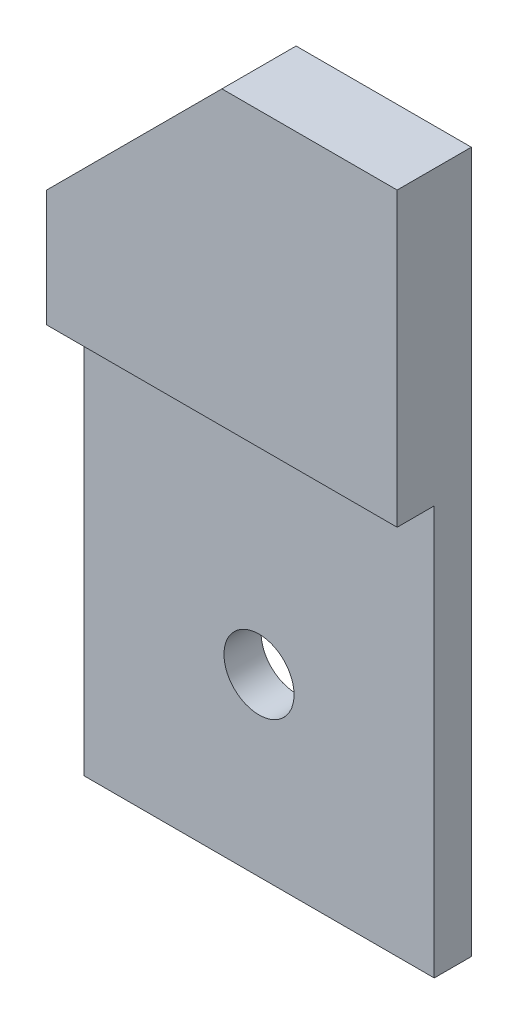
ISO-10303-21;
HEADER;
FILE_DESCRIPTION(('STEP AP214'),'2;1');
FILE_NAME('part.step','',(''),(''),'','','');
FILE_SCHEMA(('AUTOMOTIVE_DESIGN { 1 0 10303 214 1 1 1 1 }'));
ENDSEC;
DATA;
#1=APPLICATION_CONTEXT('core data for automotive mechanical design processes');
#2=APPLICATION_PROTOCOL_DEFINITION('international standard','automotive_design',2000,#1);
#3=PRODUCT_CONTEXT('',#1,'mechanical');
#4=PRODUCT('Part','Part','',(#3));
#5=PRODUCT_RELATED_PRODUCT_CATEGORY('part','',(#4));
#6=PRODUCT_DEFINITION_FORMATION('','',#4);
#7=PRODUCT_DEFINITION_CONTEXT('part definition',#1,'design');
#8=PRODUCT_DEFINITION('design','',#6,#7);
#9=PRODUCT_DEFINITION_SHAPE('','',#8);
#10=(LENGTH_UNIT() NAMED_UNIT(*) SI_UNIT(.MILLI.,.METRE.));
#11=(NAMED_UNIT(*) PLANE_ANGLE_UNIT() SI_UNIT($,.RADIAN.));
#12=(NAMED_UNIT(*) SI_UNIT($,.STERADIAN.) SOLID_ANGLE_UNIT());
#13=UNCERTAINTY_MEASURE_WITH_UNIT(LENGTH_MEASURE(1.E-05),#10,'distance_accuracy_value','');
#14=(GEOMETRIC_REPRESENTATION_CONTEXT(3) GLOBAL_UNCERTAINTY_ASSIGNED_CONTEXT((#13)) GLOBAL_UNIT_ASSIGNED_CONTEXT((#10,
#11,#12)) REPRESENTATION_CONTEXT('',''));
#15=CARTESIAN_POINT('',(0.,0.,0.));
#16=DIRECTION('',(0.,0.,1.));
#17=DIRECTION('',(1.,0.,0.));
#18=AXIS2_PLACEMENT_3D('',#15,#16,#17);
#19=CARTESIAN_POINT('',(0.,0.,3.175));
#20=DIRECTION('',(0.,0.,-1.));
#21=DIRECTION('',(-1.,0.,0.));
#22=AXIS2_PLACEMENT_3D('',#19,#20,#21);
#23=PLANE('',#22);
#24=CARTESIAN_POINT('',(15.,15.,3.175));
#25=DIRECTION('',(0.,0.,1.));
#26=DIRECTION('',(1.,0.,0.));
#27=AXIS2_PLACEMENT_3D('',#24,#25,#26);
#28=CIRCLE('',#27,3.);
#29=CARTESIAN_POINT('',(18.,15.,3.175));
#30=VERTEX_POINT('',#29);
#31=EDGE_CURVE('E115',#30,#30,#28,.T.);
#32=ORIENTED_EDGE('',*,*,#31,.F.);
#33=EDGE_LOOP('',(#32));
#34=FACE_BOUND('',#33,.T.);
#35=DIRECTION('',(1.,0.,0.));
#36=VECTOR('',#35,1.);
#37=CARTESIAN_POINT('',(0.,34.9999999999997,3.175));
#38=LINE('',#37,#36);
#39=CARTESIAN_POINT('',(0.,34.9999999999997,3.175));
#40=VERTEX_POINT('',#39);
#41=CARTESIAN_POINT('',(30.,34.9999999999997,3.175));
#42=VERTEX_POINT('',#41);
#43=EDGE_CURVE('E55',#40,#42,#38,.T.);
#44=ORIENTED_EDGE('',*,*,#43,.F.);
#45=DIRECTION('',(0.,-1.,0.));
#46=VECTOR('',#45,1.);
#47=CARTESIAN_POINT('',(0.,0.,3.175));
#48=LINE('',#47,#46);
#49=CARTESIAN_POINT('',(0.,0.,3.175));
#50=VERTEX_POINT('',#49);
#51=EDGE_CURVE('E96',#40,#50,#48,.T.);
#52=ORIENTED_EDGE('',*,*,#51,.T.);
#53=DIRECTION('',(1.,0.,0.));
#54=VECTOR('',#53,1.);
#55=CARTESIAN_POINT('',(0.,0.,3.175));
#56=LINE('',#55,#54);
#57=CARTESIAN_POINT('',(30.,0.,3.175));
#58=VERTEX_POINT('',#57);
#59=EDGE_CURVE('E61',#50,#58,#56,.T.);
#60=ORIENTED_EDGE('',*,*,#59,.T.);
#61=DIRECTION('',(0.,1.,0.));
#62=VECTOR('',#61,1.);
#63=CARTESIAN_POINT('',(30.,0.,3.175));
#64=LINE('',#63,#62);
#65=EDGE_CURVE('E108',#58,#42,#64,.T.);
#66=ORIENTED_EDGE('',*,*,#65,.T.);
#67=EDGE_LOOP('',(#44,#52,#60,#66));
#68=FACE_BOUND('',#67,.T.);
#69=ADVANCED_FACE('F39',(#34,#68),#23,.F.);
#70=CARTESIAN_POINT('',(0.,0.,0.));
#71=DIRECTION('',(0.,0.,-1.));
#72=DIRECTION('',(-1.,0.,0.));
#73=AXIS2_PLACEMENT_3D('',#70,#71,#72);
#74=PLANE('',#73);
#75=DIRECTION('',(0.,-1.,0.));
#76=VECTOR('',#75,1.);
#77=CARTESIAN_POINT('',(0.,0.,0.));
#78=LINE('',#77,#76);
#79=CARTESIAN_POINT('',(0.,44.9999999999997,0.));
#80=VERTEX_POINT('',#79);
#81=CARTESIAN_POINT('',(0.,0.,0.));
#82=VERTEX_POINT('',#81);
#83=EDGE_CURVE('E103',#80,#82,#78,.T.);
#84=ORIENTED_EDGE('',*,*,#83,.F.);
#85=DIRECTION('',(-0.707106781186541,-0.707106781186554,0.));
#86=VECTOR('',#85,1.);
#87=CARTESIAN_POINT('',(15.,60.,0.));
#88=LINE('',#87,#86);
#89=CARTESIAN_POINT('',(15.,60.,0.));
#90=VERTEX_POINT('',#89);
#91=EDGE_CURVE('E84',#90,#80,#88,.T.);
#92=ORIENTED_EDGE('',*,*,#91,.F.);
#93=DIRECTION('',(-1.,0.,0.));
#94=VECTOR('',#93,1.);
#95=CARTESIAN_POINT('',(15.,60.,0.));
#96=LINE('',#95,#94);
#97=CARTESIAN_POINT('',(30.,60.,0.));
#98=VERTEX_POINT('',#97);
#99=EDGE_CURVE('E97',#98,#90,#96,.T.);
#100=ORIENTED_EDGE('',*,*,#99,.F.);
#101=DIRECTION('',(0.,1.,0.));
#102=VECTOR('',#101,1.);
#103=CARTESIAN_POINT('',(30.,0.,0.));
#104=LINE('',#103,#102);
#105=CARTESIAN_POINT('',(30.,0.,0.));
#106=VERTEX_POINT('',#105);
#107=EDGE_CURVE('E119',#106,#98,#104,.T.);
#108=ORIENTED_EDGE('',*,*,#107,.F.);
#109=DIRECTION('',(1.,0.,0.));
#110=VECTOR('',#109,1.);
#111=CARTESIAN_POINT('',(0.,0.,0.));
#112=LINE('',#111,#110);
#113=EDGE_CURVE('E113',#82,#106,#112,.T.);
#114=ORIENTED_EDGE('',*,*,#113,.F.);
#115=EDGE_LOOP('',(#84,#92,#100,#108,#114));
#116=FACE_BOUND('',#115,.T.);
#117=CARTESIAN_POINT('',(15.,15.,0.));
#118=DIRECTION('',(0.,0.,1.));
#119=DIRECTION('',(1.,0.,0.));
#120=AXIS2_PLACEMENT_3D('',#117,#118,#119);
#121=CIRCLE('',#120,3.);
#122=CARTESIAN_POINT('',(18.,15.,0.));
#123=VERTEX_POINT('',#122);
#124=EDGE_CURVE('E122',#123,#123,#121,.T.);
#125=ORIENTED_EDGE('',*,*,#124,.T.);
#126=EDGE_LOOP('',(#125));
#127=FACE_BOUND('',#126,.T.);
#128=ADVANCED_FACE('F110',(#116,#127),#74,.T.);
#129=CARTESIAN_POINT('',(0.,0.,3.175));
#130=DIRECTION('',(1.,0.,0.));
#131=DIRECTION('',(0.,1.,0.));
#132=AXIS2_PLACEMENT_3D('',#129,#130,#131);
#133=PLANE('',#132);
#134=ORIENTED_EDGE('',*,*,#83,.T.);
#135=DIRECTION('',(0.,0.,-1.));
#136=VECTOR('',#135,1.);
#137=CARTESIAN_POINT('',(0.,0.,3.175));
#138=LINE('',#137,#136);
#139=EDGE_CURVE('E11',#50,#82,#138,.T.);
#140=ORIENTED_EDGE('',*,*,#139,.F.);
#141=ORIENTED_EDGE('',*,*,#51,.F.);
#142=DIRECTION('',(0.,0.,-1.));
#143=VECTOR('',#142,1.);
#144=CARTESIAN_POINT('',(0.,34.9999999999997,6.35));
#145=LINE('',#144,#143);
#146=CARTESIAN_POINT('',(0.,34.9999999999997,6.35));
#147=VERTEX_POINT('',#146);
#148=EDGE_CURVE('E178',#147,#40,#145,.T.);
#149=ORIENTED_EDGE('',*,*,#148,.F.);
#150=DIRECTION('',(0.,-1.,0.));
#151=VECTOR('',#150,1.);
#152=CARTESIAN_POINT('',(0.,0.,6.35));
#153=LINE('',#152,#151);
#154=CARTESIAN_POINT('',(0.,44.9999999999997,6.35));
#155=VERTEX_POINT('',#154);
#156=EDGE_CURVE('E106',#155,#147,#153,.T.);
#157=ORIENTED_EDGE('',*,*,#156,.F.);
#158=DIRECTION('',(0.,0.,-1.));
#159=VECTOR('',#158,1.);
#160=CARTESIAN_POINT('',(0.,44.9999999999997,3.175));
#161=LINE('',#160,#159);
#162=EDGE_CURVE('E88',#155,#80,#161,.T.);
#163=ORIENTED_EDGE('',*,*,#162,.T.);
#164=EDGE_LOOP('',(#134,#140,#141,#149,#157,#163));
#165=FACE_BOUND('',#164,.T.);
#166=ADVANCED_FACE('F41',(#165),#133,.F.);
#167=CARTESIAN_POINT('',(0.,0.,3.175));
#168=DIRECTION('',(0.,1.,0.));
#169=DIRECTION('',(0.,0.,1.));
#170=AXIS2_PLACEMENT_3D('',#167,#168,#169);
#171=PLANE('',#170);
#172=ORIENTED_EDGE('',*,*,#113,.T.);
#173=DIRECTION('',(0.,0.,-1.));
#174=VECTOR('',#173,1.);
#175=CARTESIAN_POINT('',(30.,0.,3.175));
#176=LINE('',#175,#174);
#177=EDGE_CURVE('E48',#58,#106,#176,.T.);
#178=ORIENTED_EDGE('',*,*,#177,.F.);
#179=ORIENTED_EDGE('',*,*,#59,.F.);
#180=ORIENTED_EDGE('',*,*,#139,.T.);
#181=EDGE_LOOP('',(#172,#178,#179,#180));
#182=FACE_BOUND('',#181,.T.);
#183=ADVANCED_FACE('F196',(#182),#171,.F.);
#184=CARTESIAN_POINT('',(30.,0.,3.175));
#185=DIRECTION('',(-1.,0.,0.));
#186=DIRECTION('',(0.,0.,1.));
#187=AXIS2_PLACEMENT_3D('',#184,#185,#186);
#188=PLANE('',#187);
#189=ORIENTED_EDGE('',*,*,#107,.T.);
#190=DIRECTION('',(0.,0.,-1.));
#191=VECTOR('',#190,1.);
#192=CARTESIAN_POINT('',(30.,60.,3.175));
#193=LINE('',#192,#191);
#194=CARTESIAN_POINT('',(30.,60.,6.35));
#195=VERTEX_POINT('',#194);
#196=EDGE_CURVE('E133',#195,#98,#193,.T.);
#197=ORIENTED_EDGE('',*,*,#196,.F.);
#198=DIRECTION('',(0.,1.,0.));
#199=VECTOR('',#198,1.);
#200=CARTESIAN_POINT('',(30.,0.,6.35));
#201=LINE('',#200,#199);
#202=CARTESIAN_POINT('',(30.,34.9999999999997,6.35));
#203=VERTEX_POINT('',#202);
#204=EDGE_CURVE('E154',#203,#195,#201,.T.);
#205=ORIENTED_EDGE('',*,*,#204,.F.);
#206=DIRECTION('',(0.,0.,-1.));
#207=VECTOR('',#206,1.);
#208=CARTESIAN_POINT('',(30.,34.9999999999997,6.35));
#209=LINE('',#208,#207);
#210=EDGE_CURVE('E173',#203,#42,#209,.T.);
#211=ORIENTED_EDGE('',*,*,#210,.T.);
#212=ORIENTED_EDGE('',*,*,#65,.F.);
#213=ORIENTED_EDGE('',*,*,#177,.T.);
#214=EDGE_LOOP('',(#189,#197,#205,#211,#212,#213));
#215=FACE_BOUND('',#214,.T.);
#216=ADVANCED_FACE('F140',(#215),#188,.F.);
#217=CARTESIAN_POINT('',(15.,60.,3.175));
#218=DIRECTION('',(0.,-1.,0.));
#219=DIRECTION('',(0.,0.,-1.));
#220=AXIS2_PLACEMENT_3D('',#217,#218,#219);
#221=PLANE('',#220);
#222=ORIENTED_EDGE('',*,*,#99,.T.);
#223=DIRECTION('',(0.,0.,-1.));
#224=VECTOR('',#223,1.);
#225=CARTESIAN_POINT('',(15.,60.,3.175));
#226=LINE('',#225,#224);
#227=CARTESIAN_POINT('',(15.,60.,6.35));
#228=VERTEX_POINT('',#227);
#229=EDGE_CURVE('E91',#228,#90,#226,.T.);
#230=ORIENTED_EDGE('',*,*,#229,.F.);
#231=DIRECTION('',(-1.,0.,0.));
#232=VECTOR('',#231,1.);
#233=CARTESIAN_POINT('',(0.,60.,6.35));
#234=LINE('',#233,#232);
#235=EDGE_CURVE('E150',#195,#228,#234,.T.);
#236=ORIENTED_EDGE('',*,*,#235,.F.);
#237=ORIENTED_EDGE('',*,*,#196,.T.);
#238=EDGE_LOOP('',(#222,#230,#236,#237));
#239=FACE_BOUND('',#238,.T.);
#240=ADVANCED_FACE('F145',(#239),#221,.F.);
#241=CARTESIAN_POINT('',(15.,60.,3.175));
#242=DIRECTION('',(0.707106781186554,-0.707106781186541,0.));
#243=DIRECTION('',(0.707106781186541,0.707106781186554,0.));
#244=AXIS2_PLACEMENT_3D('',#241,#242,#243);
#245=PLANE('',#244);
#246=ORIENTED_EDGE('',*,*,#91,.T.);
#247=ORIENTED_EDGE('',*,*,#162,.F.);
#248=DIRECTION('',(-0.707106781186541,-0.707106781186554,0.));
#249=VECTOR('',#248,1.);
#250=CARTESIAN_POINT('',(-22.4999999999999,22.4999999999995,6.35));
#251=LINE('',#250,#249);
#252=EDGE_CURVE('E166',#228,#155,#251,.T.);
#253=ORIENTED_EDGE('',*,*,#252,.F.);
#254=ORIENTED_EDGE('',*,*,#229,.T.);
#255=EDGE_LOOP('',(#246,#247,#253,#254));
#256=FACE_BOUND('',#255,.T.);
#257=ADVANCED_FACE('F86',(#256),#245,.F.);
#258=CARTESIAN_POINT('',(15.,15.,3.175));
#259=DIRECTION('',(0.,0.,-1.));
#260=DIRECTION('',(-1.,0.,0.));
#261=AXIS2_PLACEMENT_3D('',#258,#259,#260);
#262=CYLINDRICAL_SURFACE('',#261,3.);
#263=ORIENTED_EDGE('',*,*,#31,.T.);
#264=EDGE_LOOP('',(#263));
#265=FACE_BOUND('',#264,.T.);
#266=ORIENTED_EDGE('',*,*,#124,.F.);
#267=EDGE_LOOP('',(#266));
#268=FACE_BOUND('',#267,.T.);
#269=ADVANCED_FACE('F215',(#265,#268),#262,.F.);
#270=CARTESIAN_POINT('',(0.,34.9999999999997,6.35));
#271=DIRECTION('',(0.,1.,0.));
#272=DIRECTION('',(0.,0.,1.));
#273=AXIS2_PLACEMENT_3D('',#270,#271,#272);
#274=PLANE('',#273);
#275=ORIENTED_EDGE('',*,*,#43,.T.);
#276=ORIENTED_EDGE('',*,*,#210,.F.);
#277=DIRECTION('',(1.,0.,0.));
#278=VECTOR('',#277,1.);
#279=CARTESIAN_POINT('',(0.,34.9999999999997,6.35));
#280=LINE('',#279,#278);
#281=EDGE_CURVE('E160',#147,#203,#280,.T.);
#282=ORIENTED_EDGE('',*,*,#281,.F.);
#283=ORIENTED_EDGE('',*,*,#148,.T.);
#284=EDGE_LOOP('',(#275,#276,#282,#283));
#285=FACE_BOUND('',#284,.T.);
#286=ADVANCED_FACE('F191',(#285),#274,.F.);
#287=CARTESIAN_POINT('',(0.,0.,6.35));
#288=DIRECTION('',(0.,0.,1.));
#289=DIRECTION('',(1.,0.,0.));
#290=AXIS2_PLACEMENT_3D('',#287,#288,#289);
#291=PLANE('',#290);
#292=ORIENTED_EDGE('',*,*,#156,.T.);
#293=ORIENTED_EDGE('',*,*,#281,.T.);
#294=ORIENTED_EDGE('',*,*,#204,.T.);
#295=ORIENTED_EDGE('',*,*,#235,.T.);
#296=ORIENTED_EDGE('',*,*,#252,.T.);
#297=EDGE_LOOP('',(#292,#293,#294,#295,#296));
#298=FACE_BOUND('',#297,.T.);
#299=ADVANCED_FACE('F158',(#298),#291,.T.);
#300=CLOSED_SHELL('',(#69,#128,#166,#183,#216,#240,#257,#269,#286,#299));
#301=MANIFOLD_SOLID_BREP('B2',#300);
#302=ADVANCED_BREP_SHAPE_REPRESENTATION('',(#18,#301),#14);
#303=SHAPE_DEFINITION_REPRESENTATION(#9,#302);
ENDSEC;
END-ISO-10303-21;
